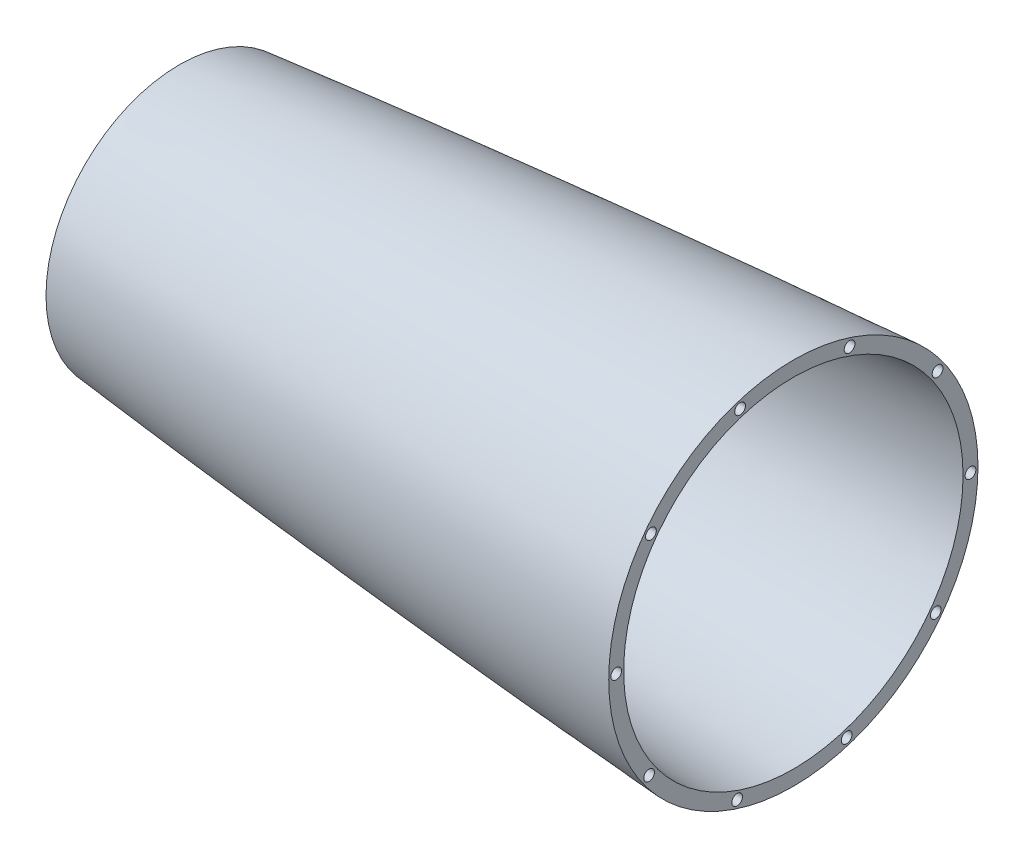
ISO-10303-21;
HEADER;
FILE_DESCRIPTION(('STEP AP214'),'2;1');
FILE_NAME('part.step','',(''),(''),'','','');
FILE_SCHEMA(('AUTOMOTIVE_DESIGN { 1 0 10303 214 1 1 1 1 }'));
ENDSEC;
DATA;
#1=APPLICATION_CONTEXT('core data for automotive mechanical design processes');
#2=APPLICATION_PROTOCOL_DEFINITION('international standard','automotive_design',2000,#1);
#3=PRODUCT_CONTEXT('',#1,'mechanical');
#4=PRODUCT('Part','Part','',(#3));
#5=PRODUCT_RELATED_PRODUCT_CATEGORY('part','',(#4));
#6=PRODUCT_DEFINITION_FORMATION('','',#4);
#7=PRODUCT_DEFINITION_CONTEXT('part definition',#1,'design');
#8=PRODUCT_DEFINITION('design','',#6,#7);
#9=PRODUCT_DEFINITION_SHAPE('','',#8);
#10=(LENGTH_UNIT() NAMED_UNIT(*) SI_UNIT(.MILLI.,.METRE.));
#11=(NAMED_UNIT(*) PLANE_ANGLE_UNIT() SI_UNIT($,.RADIAN.));
#12=(NAMED_UNIT(*) SI_UNIT($,.STERADIAN.) SOLID_ANGLE_UNIT());
#13=UNCERTAINTY_MEASURE_WITH_UNIT(LENGTH_MEASURE(1.E-05),#10,'distance_accuracy_value','');
#14=(GEOMETRIC_REPRESENTATION_CONTEXT(3) GLOBAL_UNCERTAINTY_ASSIGNED_CONTEXT((#13)) GLOBAL_UNIT_ASSIGNED_CONTEXT((#10,
#11,#12)) REPRESENTATION_CONTEXT('',''));
#15=CARTESIAN_POINT('',(0.,0.,0.));
#16=DIRECTION('',(0.,0.,1.));
#17=DIRECTION('',(1.,0.,0.));
#18=AXIS2_PLACEMENT_3D('',#15,#16,#17);
#19=CARTESIAN_POINT('',(-259.812483714893,11.460570284297,0.));
#20=CARTESIAN_POINT('',(-287.312106379697,10.5623408515305,0.));
#21=CARTESIAN_POINT('',(-342.298022137353,8.17156900853598,0.));
#22=CARTESIAN_POINT('',(-452.140135715747,1.83352473554385,0.));
#23=CARTESIAN_POINT('',(-589.280273051557,-8.5121188078909,0.));
#24=CARTESIAN_POINT('',(-726.176632388446,-21.7709007537404,0.));
#25=CARTESIAN_POINT('',(-835.465785428388,-34.5887261399924,0.));
#26=CARTESIAN_POINT('',(-890.027026606975,-41.9652027624198,0.));
#27=CARTESIAN_POINT('',(-917.245364412614,-46.0396236215406,0.));
#28=B_SPLINE_CURVE_WITH_KNOTS('',3,(#19,#20,#21,#22,#23,#24,#25,#26,#27),.UNSPECIFIED.,.F.,.F.,
(4,1,1,1,1,1,4),(0.121539177885851,0.200323508121493,0.279107838357135,0.436676498828419,
0.594245159299703,0.673029489535345,0.751813819770986),.UNSPECIFIED.);
#29=CARTESIAN_POINT('',(0.,-76.2,0.));
#30=DIRECTION('',(1.,0.,0.));
#31=AXIS1_PLACEMENT('',#29,#30);
#32=SURFACE_OF_REVOLUTION('',#28,#31);
#33=CARTESIAN_POINT('',(-699.4652,-76.2,0.));
#34=DIRECTION('',(1.,0.,0.));
#35=DIRECTION('',(0.,0.,-1.));
#36=AXIS2_PLACEMENT_3D('',#33,#34,#35);
#37=CIRCLE('',#36,56.7704938591752);
#38=CARTESIAN_POINT('',(-699.4652,-76.2,-56.7704938591752));
#39=VERTEX_POINT('',#38);
#40=EDGE_CURVE('E163',#39,#39,#37,.F.);
#41=ORIENTED_EDGE('',*,*,#40,.F.);
#42=EDGE_LOOP('',(#41));
#43=FACE_BOUND('',#42,.T.);
#44=CARTESIAN_POINT('',(-438.15,-76.2,0.));
#45=DIRECTION('',(1.,0.,0.));
#46=DIRECTION('',(0.,0.,-1.));
#47=AXIS2_PLACEMENT_3D('',#44,#45,#46);
#48=CIRCLE('',#47,78.5859575802931);
#49=CARTESIAN_POINT('',(-438.15,-76.2,-78.5859575802931));
#50=VERTEX_POINT('',#49);
#51=EDGE_CURVE('E10',#50,#50,#48,.F.);
#52=ORIENTED_EDGE('',*,*,#51,.T.);
#53=EDGE_LOOP('',(#52));
#54=FACE_BOUND('',#53,.T.);
#55=ADVANCED_FACE('F32',(#43,#54),#32,.F.);
#56=CARTESIAN_POINT('',(-259.605182082093,5.11395496327444,0.));
#57=CARTESIAN_POINT('',(-267.12768254606,4.86824499819252,0.));
#58=CARTESIAN_POINT('',(-283.426031509972,4.28566928092725,0.));
#59=CARTESIAN_POINT('',(-317.270262328934,2.88050564552106,0.));
#60=CARTESIAN_POINT('',(-361.130016616179,0.711244662128463,0.));
#61=CARTESIAN_POINT('',(-431.275457268552,-3.37195649395594,0.));
#62=CARTESIAN_POINT('',(-501.372917975129,-8.26687627302136,0.));
#63=CARTESIAN_POINT('',(-571.414486842692,-13.8916826479783,0.));
#64=CARTESIAN_POINT('',(-623.914744737059,-18.4776988889442,0.));
#65=CARTESIAN_POINT('',(-676.380314026956,-23.4393497952148,0.));
#66=CARTESIAN_POINT('',(-728.805663240347,-28.7990620723279,0.));
#67=CARTESIAN_POINT('',(-772.453634614019,-33.627485173269,0.));
#68=CARTESIAN_POINT('',(-807.341816529924,-37.7391545432386,0.));
#69=CARTESIAN_POINT('',(-833.490683910714,-40.9589001471484,0.));
#70=CARTESIAN_POINT('',(-859.619375691871,-44.3289411148186,0.));
#71=CARTESIAN_POINT('',(-885.723877264818,-47.8693351323976,0.));
#72=CARTESIAN_POINT('',(-904.61249297492,-50.577906922154,0.));
#73=CARTESIAN_POINT('',(-914.800968172167,-52.0944643953555,0.));
#74=CARTESIAN_POINT('',(-916.305282206307,-52.3196511250938,0.));
#75=B_SPLINE_CURVE_WITH_KNOTS('',3,(#56,#57,#58,#59,#60,#61,#62,#63,#64,#65,#66,#67,#68,#69,#70,
#71,#72,#73,#74),.UNSPECIFIED.,.F.,.F.,(4,1,1,1,1,1,1,1,1,1,1,1,1,1,1,1,4),(0.121539177885851,
0.143122913317239,0.168303261053087,0.218663956524784,0.26902465199648,0.369746042939873,
0.420106738411569,0.470467433883266,0.520828129354962,0.571188824826659,0.621549520298355,
0.646729868034203,0.671910215770052,0.6970905635059,0.722270911241748,0.747451258977596,
0.751813819770986),.UNSPECIFIED.);
#76=CARTESIAN_POINT('',(0.,-76.2,0.));
#77=DIRECTION('',(1.,0.,0.));
#78=AXIS1_PLACEMENT('',#76,#77);
#79=SURFACE_OF_REVOLUTION('',#75,#78);
#80=CARTESIAN_POINT('',(-699.4652,-76.2,0.));
#81=DIRECTION('',(1.,0.,0.));
#82=DIRECTION('',(0.,0.,-1.));
#83=AXIS2_PLACEMENT_3D('',#80,#81,#82);
#84=CIRCLE('',#83,50.3825636245439);
#85=CARTESIAN_POINT('',(-699.4652,-76.2,-50.3825636245439));
#86=VERTEX_POINT('',#85);
#87=EDGE_CURVE('E36',#86,#86,#84,.F.);
#88=ORIENTED_EDGE('',*,*,#87,.T.);
#89=EDGE_LOOP('',(#88));
#90=FACE_BOUND('',#89,.T.);
#91=CARTESIAN_POINT('',(-438.15,-76.2,0.));
#92=DIRECTION('',(1.,0.,0.));
#93=DIRECTION('',(0.,0.,-1.));
#94=AXIS2_PLACEMENT_3D('',#91,#92,#93);
#95=CIRCLE('',#94,72.2219194807445);
#96=CARTESIAN_POINT('',(-438.15,-76.2,-72.2219194807445));
#97=VERTEX_POINT('',#96);
#98=EDGE_CURVE('E40',#97,#97,#95,.F.);
#99=ORIENTED_EDGE('',*,*,#98,.F.);
#100=EDGE_LOOP('',(#99));
#101=FACE_BOUND('',#100,.T.);
#102=ADVANCED_FACE('F62',(#90,#101),#79,.T.);
#103=CARTESIAN_POINT('',(-438.15,-76.2,0.));
#104=DIRECTION('',(1.,0.,0.));
#105=DIRECTION('',(0.,0.,-1.));
#106=AXIS2_PLACEMENT_3D('',#103,#104,#105);
#107=PLANE('',#106);
#108=CARTESIAN_POINT('',(-438.15,-4.28598565713197,22.6744016257323));
#109=DIRECTION('',(1.,0.,0.));
#110=DIRECTION('',(0.,0.,-1.));
#111=AXIS2_PLACEMENT_3D('',#108,#109,#110);
#112=CIRCLE('',#111,2.286);
#113=CARTESIAN_POINT('',(-438.15,-4.28598565713197,20.3884016257323));
#114=VERTEX_POINT('',#113);
#115=EDGE_CURVE('E164',#114,#114,#112,.T.);
#116=ORIENTED_EDGE('',*,*,#115,.F.);
#117=EDGE_LOOP('',(#116));
#118=FACE_BOUND('',#117,.T.);
#119=CARTESIAN_POINT('',(-438.15,-31.3480191430601,60.6139733163877));
#120=DIRECTION('',(1.,0.,0.));
#121=DIRECTION('',(0.,0.,-1.));
#122=AXIS2_PLACEMENT_3D('',#119,#120,#121);
#123=CIRCLE('',#122,2.286);
#124=CARTESIAN_POINT('',(-438.15,-31.3480191430601,58.3279733163877));
#125=VERTEX_POINT('',#124);
#126=EDGE_CURVE('E216',#125,#125,#123,.T.);
#127=ORIENTED_EDGE('',*,*,#126,.F.);
#128=EDGE_LOOP('',(#127));
#129=FACE_BOUND('',#128,.T.);
#130=CARTESIAN_POINT('',(-438.15,-75.5419848535801,75.4010673933609));
#131=DIRECTION('',(1.,0.,0.));
#132=DIRECTION('',(0.,0.,-1.));
#133=AXIS2_PLACEMENT_3D('',#130,#131,#132);
#134=CIRCLE('',#133,2.286);
#135=CARTESIAN_POINT('',(-438.15,-75.5419848535801,73.1150673933609));
#136=VERTEX_POINT('',#135);
#137=EDGE_CURVE('E210',#136,#136,#134,.T.);
#138=ORIENTED_EDGE('',*,*,#137,.F.);
#139=EDGE_LOOP('',(#138));
#140=FACE_BOUND('',#139,.T.);
#141=CARTESIAN_POINT('',(-438.15,-119.987289984921,61.3875165140904));
#142=DIRECTION('',(1.,0.,0.));
#143=DIRECTION('',(0.,0.,-1.));
#144=AXIS2_PLACEMENT_3D('',#141,#142,#143);
#145=CIRCLE('',#144,2.28599999999998);
#146=CARTESIAN_POINT('',(-438.15,-119.987289984921,59.1015165140904));
#147=VERTEX_POINT('',#146);
#148=EDGE_CURVE('E204',#147,#147,#145,.T.);
#149=ORIENTED_EDGE('',*,*,#148,.F.);
#150=EDGE_LOOP('',(#149));
#151=FACE_BOUND('',#150,.T.);
#152=CARTESIAN_POINT('',(-438.15,-147.70733861727,23.9260208113815));
#153=DIRECTION('',(1.,0.,0.));
#154=DIRECTION('',(0.,0.,-1.));
#155=AXIS2_PLACEMENT_3D('',#152,#153,#154);
#156=CIRCLE('',#155,2.286);
#157=CARTESIAN_POINT('',(-438.15,-147.70733861727,21.6400208113815));
#158=VERTEX_POINT('',#157);
#159=EDGE_CURVE('E198',#158,#158,#156,.T.);
#160=ORIENTED_EDGE('',*,*,#159,.F.);
#161=EDGE_LOOP('',(#160));
#162=FACE_BOUND('',#161,.T.);
#163=CARTESIAN_POINT('',(-438.15,-148.11401434287,-22.6744016257389));
#164=DIRECTION('',(1.,0.,0.));
#165=DIRECTION('',(0.,0.,-1.));
#166=AXIS2_PLACEMENT_3D('',#163,#164,#165);
#167=CIRCLE('',#166,2.28600000000001);
#168=CARTESIAN_POINT('',(-438.15,-148.11401434287,-24.9604016257389));
#169=VERTEX_POINT('',#168);
#170=EDGE_CURVE('E192',#169,#169,#167,.T.);
#171=ORIENTED_EDGE('',*,*,#170,.F.);
#172=EDGE_LOOP('',(#171));
#173=FACE_BOUND('',#172,.T.);
#174=CARTESIAN_POINT('',(-438.15,-121.051980856942,-60.6139733163942));
#175=DIRECTION('',(1.,0.,0.));
#176=DIRECTION('',(0.,0.,-1.));
#177=AXIS2_PLACEMENT_3D('',#174,#175,#176);
#178=CIRCLE('',#177,2.286);
#179=CARTESIAN_POINT('',(-438.15,-121.051980856942,-62.8999733163942));
#180=VERTEX_POINT('',#179);
#181=EDGE_CURVE('E186',#180,#180,#178,.T.);
#182=ORIENTED_EDGE('',*,*,#181,.F.);
#183=EDGE_LOOP('',(#182));
#184=FACE_BOUND('',#183,.T.);
#185=CARTESIAN_POINT('',(-438.15,-76.8580151464216,-75.401067393367));
#186=DIRECTION('',(1.,0.,0.));
#187=DIRECTION('',(0.,0.,-1.));
#188=AXIS2_PLACEMENT_3D('',#185,#186,#187);
#189=CIRCLE('',#188,2.28599999999999);
#190=CARTESIAN_POINT('',(-438.15,-76.8580151464216,-77.687067393367));
#191=VERTEX_POINT('',#190);
#192=EDGE_CURVE('E180',#191,#191,#189,.T.);
#193=ORIENTED_EDGE('',*,*,#192,.F.);
#194=EDGE_LOOP('',(#193));
#195=FACE_BOUND('',#194,.T.);
#196=CARTESIAN_POINT('',(-438.15,-32.4127100150811,-61.3875165140962));
#197=DIRECTION('',(1.,0.,0.));
#198=DIRECTION('',(0.,0.,-1.));
#199=AXIS2_PLACEMENT_3D('',#196,#197,#198);
#200=CIRCLE('',#199,2.286);
#201=CARTESIAN_POINT('',(-438.15,-32.4127100150811,-63.6735165140962));
#202=VERTEX_POINT('',#201);
#203=EDGE_CURVE('E174',#202,#202,#200,.T.);
#204=ORIENTED_EDGE('',*,*,#203,.F.);
#205=EDGE_LOOP('',(#204));
#206=FACE_BOUND('',#205,.T.);
#207=CARTESIAN_POINT('',(-438.15,-4.69266138273224,-23.9260208113871));
#208=DIRECTION('',(1.,0.,0.));
#209=DIRECTION('',(0.,0.,-1.));
#210=AXIS2_PLACEMENT_3D('',#207,#208,#209);
#211=CIRCLE('',#210,2.286);
#212=CARTESIAN_POINT('',(-438.15,-4.69266138273224,-26.2120208113871));
#213=VERTEX_POINT('',#212);
#214=EDGE_CURVE('E47',#213,#213,#211,.T.);
#215=ORIENTED_EDGE('',*,*,#214,.F.);
#216=EDGE_LOOP('',(#215));
#217=FACE_BOUND('',#216,.T.);
#218=ORIENTED_EDGE('',*,*,#51,.F.);
#219=EDGE_LOOP('',(#218));
#220=FACE_BOUND('',#219,.T.);
#221=ORIENTED_EDGE('',*,*,#98,.T.);
#222=EDGE_LOOP('',(#221));
#223=FACE_BOUND('',#222,.T.);
#224=ADVANCED_FACE('F65',(#118,#129,#140,#151,#162,#173,#184,#195,#206,#217,#220,#223),#107,.T.);
#225=CARTESIAN_POINT('',(-448.31,-4.69266138273224,-23.9260208113871));
#226=DIRECTION('',(1.,0.,0.));
#227=DIRECTION('',(0.,0.,-1.));
#228=AXIS2_PLACEMENT_3D('',#225,#226,#227);
#229=CYLINDRICAL_SURFACE('',#228,2.286);
#230=CARTESIAN_POINT('',(-448.31,-4.69266138273224,-23.9260208113871));
#231=DIRECTION('',(1.,0.,0.));
#232=DIRECTION('',(0.,0.,-1.));
#233=AXIS2_PLACEMENT_3D('',#230,#231,#232);
#234=CIRCLE('',#233,2.286);
#235=CARTESIAN_POINT('',(-448.31,-4.69266138273224,-26.2120208113871));
#236=VERTEX_POINT('',#235);
#237=EDGE_CURVE('E45',#236,#236,#234,.T.);
#238=ORIENTED_EDGE('',*,*,#237,.F.);
#239=EDGE_LOOP('',(#238));
#240=FACE_BOUND('',#239,.T.);
#241=ORIENTED_EDGE('',*,*,#214,.T.);
#242=EDGE_LOOP('',(#241));
#243=FACE_BOUND('',#242,.T.);
#244=ADVANCED_FACE('F69',(#240,#243),#229,.F.);
#245=CARTESIAN_POINT('',(-448.31,-4.69266138273224,-23.9260208113871));
#246=DIRECTION('',(1.,0.,0.));
#247=DIRECTION('',(0.,0.,-1.));
#248=AXIS2_PLACEMENT_3D('',#245,#246,#247);
#249=PLANE('',#248);
#250=ORIENTED_EDGE('',*,*,#237,.T.);
#251=EDGE_LOOP('',(#250));
#252=FACE_BOUND('',#251,.T.);
#253=ADVANCED_FACE('F73',(#252),#249,.T.);
#254=CARTESIAN_POINT('',(-448.31,-32.4127100150811,-61.3875165140962));
#255=DIRECTION('',(1.,0.,0.));
#256=DIRECTION('',(0.,0.,-1.));
#257=AXIS2_PLACEMENT_3D('',#254,#255,#256);
#258=CYLINDRICAL_SURFACE('',#257,2.286);
#259=CARTESIAN_POINT('',(-448.31,-32.4127100150811,-61.3875165140962));
#260=DIRECTION('',(1.,0.,0.));
#261=DIRECTION('',(0.,0.,-1.));
#262=AXIS2_PLACEMENT_3D('',#259,#260,#261);
#263=CIRCLE('',#262,2.286);
#264=CARTESIAN_POINT('',(-448.31,-32.4127100150811,-63.6735165140962));
#265=VERTEX_POINT('',#264);
#266=EDGE_CURVE('E171',#265,#265,#263,.T.);
#267=ORIENTED_EDGE('',*,*,#266,.F.);
#268=EDGE_LOOP('',(#267));
#269=FACE_BOUND('',#268,.T.);
#270=ORIENTED_EDGE('',*,*,#203,.T.);
#271=EDGE_LOOP('',(#270));
#272=FACE_BOUND('',#271,.T.);
#273=ADVANCED_FACE('F77',(#269,#272),#258,.F.);
#274=CARTESIAN_POINT('',(-448.31,-32.4127100150811,-61.3875165140962));
#275=DIRECTION('',(1.,0.,0.));
#276=DIRECTION('',(0.,0.,-1.));
#277=AXIS2_PLACEMENT_3D('',#274,#275,#276);
#278=PLANE('',#277);
#279=ORIENTED_EDGE('',*,*,#266,.T.);
#280=EDGE_LOOP('',(#279));
#281=FACE_BOUND('',#280,.T.);
#282=ADVANCED_FACE('F140',(#281),#278,.T.);
#283=CARTESIAN_POINT('',(-448.31,-76.8580151464216,-75.401067393367));
#284=DIRECTION('',(1.,0.,0.));
#285=DIRECTION('',(0.,0.,-1.));
#286=AXIS2_PLACEMENT_3D('',#283,#284,#285);
#287=CYLINDRICAL_SURFACE('',#286,2.28599999999999);
#288=CARTESIAN_POINT('',(-448.31,-76.8580151464216,-75.401067393367));
#289=DIRECTION('',(1.,0.,0.));
#290=DIRECTION('',(0.,0.,-1.));
#291=AXIS2_PLACEMENT_3D('',#288,#289,#290);
#292=CIRCLE('',#291,2.28599999999999);
#293=CARTESIAN_POINT('',(-448.31,-76.8580151464216,-77.687067393367));
#294=VERTEX_POINT('',#293);
#295=EDGE_CURVE('E177',#294,#294,#292,.T.);
#296=ORIENTED_EDGE('',*,*,#295,.F.);
#297=EDGE_LOOP('',(#296));
#298=FACE_BOUND('',#297,.T.);
#299=ORIENTED_EDGE('',*,*,#192,.T.);
#300=EDGE_LOOP('',(#299));
#301=FACE_BOUND('',#300,.T.);
#302=ADVANCED_FACE('F137',(#298,#301),#287,.F.);
#303=CARTESIAN_POINT('',(-448.31,-76.8580151464216,-75.401067393367));
#304=DIRECTION('',(1.,0.,0.));
#305=DIRECTION('',(0.,0.,-1.));
#306=AXIS2_PLACEMENT_3D('',#303,#304,#305);
#307=PLANE('',#306);
#308=ORIENTED_EDGE('',*,*,#295,.T.);
#309=EDGE_LOOP('',(#308));
#310=FACE_BOUND('',#309,.T.);
#311=ADVANCED_FACE('F132',(#310),#307,.T.);
#312=CARTESIAN_POINT('',(-448.31,-121.051980856942,-60.6139733163942));
#313=DIRECTION('',(1.,0.,0.));
#314=DIRECTION('',(0.,0.,-1.));
#315=AXIS2_PLACEMENT_3D('',#312,#313,#314);
#316=CYLINDRICAL_SURFACE('',#315,2.286);
#317=CARTESIAN_POINT('',(-448.31,-121.051980856942,-60.6139733163942));
#318=DIRECTION('',(1.,0.,0.));
#319=DIRECTION('',(0.,0.,-1.));
#320=AXIS2_PLACEMENT_3D('',#317,#318,#319);
#321=CIRCLE('',#320,2.286);
#322=CARTESIAN_POINT('',(-448.31,-121.051980856942,-62.8999733163942));
#323=VERTEX_POINT('',#322);
#324=EDGE_CURVE('E183',#323,#323,#321,.T.);
#325=ORIENTED_EDGE('',*,*,#324,.F.);
#326=EDGE_LOOP('',(#325));
#327=FACE_BOUND('',#326,.T.);
#328=ORIENTED_EDGE('',*,*,#181,.T.);
#329=EDGE_LOOP('',(#328));
#330=FACE_BOUND('',#329,.T.);
#331=ADVANCED_FACE('F129',(#327,#330),#316,.F.);
#332=CARTESIAN_POINT('',(-448.31,-121.051980856942,-60.6139733163942));
#333=DIRECTION('',(1.,0.,0.));
#334=DIRECTION('',(0.,0.,-1.));
#335=AXIS2_PLACEMENT_3D('',#332,#333,#334);
#336=PLANE('',#335);
#337=ORIENTED_EDGE('',*,*,#324,.T.);
#338=EDGE_LOOP('',(#337));
#339=FACE_BOUND('',#338,.T.);
#340=ADVANCED_FACE('F124',(#339),#336,.T.);
#341=CARTESIAN_POINT('',(-448.31,-148.11401434287,-22.6744016257389));
#342=DIRECTION('',(1.,0.,0.));
#343=DIRECTION('',(0.,0.,-1.));
#344=AXIS2_PLACEMENT_3D('',#341,#342,#343);
#345=CYLINDRICAL_SURFACE('',#344,2.28600000000001);
#346=CARTESIAN_POINT('',(-448.31,-148.11401434287,-22.6744016257389));
#347=DIRECTION('',(1.,0.,0.));
#348=DIRECTION('',(0.,0.,-1.));
#349=AXIS2_PLACEMENT_3D('',#346,#347,#348);
#350=CIRCLE('',#349,2.28600000000001);
#351=CARTESIAN_POINT('',(-448.31,-148.11401434287,-24.9604016257389));
#352=VERTEX_POINT('',#351);
#353=EDGE_CURVE('E189',#352,#352,#350,.T.);
#354=ORIENTED_EDGE('',*,*,#353,.F.);
#355=EDGE_LOOP('',(#354));
#356=FACE_BOUND('',#355,.T.);
#357=ORIENTED_EDGE('',*,*,#170,.T.);
#358=EDGE_LOOP('',(#357));
#359=FACE_BOUND('',#358,.T.);
#360=ADVANCED_FACE('F121',(#356,#359),#345,.F.);
#361=CARTESIAN_POINT('',(-448.31,-148.11401434287,-22.6744016257389));
#362=DIRECTION('',(1.,0.,0.));
#363=DIRECTION('',(0.,0.,-1.));
#364=AXIS2_PLACEMENT_3D('',#361,#362,#363);
#365=PLANE('',#364);
#366=ORIENTED_EDGE('',*,*,#353,.T.);
#367=EDGE_LOOP('',(#366));
#368=FACE_BOUND('',#367,.T.);
#369=ADVANCED_FACE('F116',(#368),#365,.T.);
#370=CARTESIAN_POINT('',(-448.31,-147.70733861727,23.9260208113815));
#371=DIRECTION('',(1.,0.,0.));
#372=DIRECTION('',(0.,0.,-1.));
#373=AXIS2_PLACEMENT_3D('',#370,#371,#372);
#374=CYLINDRICAL_SURFACE('',#373,2.286);
#375=CARTESIAN_POINT('',(-448.31,-147.70733861727,23.9260208113815));
#376=DIRECTION('',(1.,0.,0.));
#377=DIRECTION('',(0.,0.,-1.));
#378=AXIS2_PLACEMENT_3D('',#375,#376,#377);
#379=CIRCLE('',#378,2.286);
#380=CARTESIAN_POINT('',(-448.31,-147.70733861727,21.6400208113815));
#381=VERTEX_POINT('',#380);
#382=EDGE_CURVE('E195',#381,#381,#379,.T.);
#383=ORIENTED_EDGE('',*,*,#382,.F.);
#384=EDGE_LOOP('',(#383));
#385=FACE_BOUND('',#384,.T.);
#386=ORIENTED_EDGE('',*,*,#159,.T.);
#387=EDGE_LOOP('',(#386));
#388=FACE_BOUND('',#387,.T.);
#389=ADVANCED_FACE('F113',(#385,#388),#374,.F.);
#390=CARTESIAN_POINT('',(-448.31,-147.70733861727,23.9260208113815));
#391=DIRECTION('',(1.,0.,0.));
#392=DIRECTION('',(0.,0.,-1.));
#393=AXIS2_PLACEMENT_3D('',#390,#391,#392);
#394=PLANE('',#393);
#395=ORIENTED_EDGE('',*,*,#382,.T.);
#396=EDGE_LOOP('',(#395));
#397=FACE_BOUND('',#396,.T.);
#398=ADVANCED_FACE('F108',(#397),#394,.T.);
#399=CARTESIAN_POINT('',(-448.31,-119.987289984921,61.3875165140904));
#400=DIRECTION('',(1.,0.,0.));
#401=DIRECTION('',(0.,0.,-1.));
#402=AXIS2_PLACEMENT_3D('',#399,#400,#401);
#403=CYLINDRICAL_SURFACE('',#402,2.28599999999998);
#404=CARTESIAN_POINT('',(-448.31,-119.987289984921,61.3875165140904));
#405=DIRECTION('',(1.,0.,0.));
#406=DIRECTION('',(0.,0.,-1.));
#407=AXIS2_PLACEMENT_3D('',#404,#405,#406);
#408=CIRCLE('',#407,2.28599999999998);
#409=CARTESIAN_POINT('',(-448.31,-119.987289984921,59.1015165140904));
#410=VERTEX_POINT('',#409);
#411=EDGE_CURVE('E201',#410,#410,#408,.T.);
#412=ORIENTED_EDGE('',*,*,#411,.F.);
#413=EDGE_LOOP('',(#412));
#414=FACE_BOUND('',#413,.T.);
#415=ORIENTED_EDGE('',*,*,#148,.T.);
#416=EDGE_LOOP('',(#415));
#417=FACE_BOUND('',#416,.T.);
#418=ADVANCED_FACE('F105',(#414,#417),#403,.F.);
#419=CARTESIAN_POINT('',(-448.31,-119.987289984921,61.3875165140904));
#420=DIRECTION('',(1.,0.,0.));
#421=DIRECTION('',(0.,0.,-1.));
#422=AXIS2_PLACEMENT_3D('',#419,#420,#421);
#423=PLANE('',#422);
#424=ORIENTED_EDGE('',*,*,#411,.T.);
#425=EDGE_LOOP('',(#424));
#426=FACE_BOUND('',#425,.T.);
#427=ADVANCED_FACE('F100',(#426),#423,.T.);
#428=CARTESIAN_POINT('',(-448.31,-75.5419848535801,75.4010673933609));
#429=DIRECTION('',(1.,0.,0.));
#430=DIRECTION('',(0.,0.,-1.));
#431=AXIS2_PLACEMENT_3D('',#428,#429,#430);
#432=CYLINDRICAL_SURFACE('',#431,2.286);
#433=CARTESIAN_POINT('',(-448.31,-75.5419848535801,75.4010673933609));
#434=DIRECTION('',(1.,0.,0.));
#435=DIRECTION('',(0.,0.,-1.));
#436=AXIS2_PLACEMENT_3D('',#433,#434,#435);
#437=CIRCLE('',#436,2.286);
#438=CARTESIAN_POINT('',(-448.31,-75.5419848535801,73.1150673933609));
#439=VERTEX_POINT('',#438);
#440=EDGE_CURVE('E207',#439,#439,#437,.T.);
#441=ORIENTED_EDGE('',*,*,#440,.F.);
#442=EDGE_LOOP('',(#441));
#443=FACE_BOUND('',#442,.T.);
#444=ORIENTED_EDGE('',*,*,#137,.T.);
#445=EDGE_LOOP('',(#444));
#446=FACE_BOUND('',#445,.T.);
#447=ADVANCED_FACE('F97',(#443,#446),#432,.F.);
#448=CARTESIAN_POINT('',(-448.31,-75.5419848535801,75.4010673933609));
#449=DIRECTION('',(1.,0.,0.));
#450=DIRECTION('',(0.,0.,-1.));
#451=AXIS2_PLACEMENT_3D('',#448,#449,#450);
#452=PLANE('',#451);
#453=ORIENTED_EDGE('',*,*,#440,.T.);
#454=EDGE_LOOP('',(#453));
#455=FACE_BOUND('',#454,.T.);
#456=ADVANCED_FACE('F92',(#455),#452,.T.);
#457=CARTESIAN_POINT('',(-448.31,-31.3480191430601,60.6139733163877));
#458=DIRECTION('',(1.,0.,0.));
#459=DIRECTION('',(0.,0.,-1.));
#460=AXIS2_PLACEMENT_3D('',#457,#458,#459);
#461=CYLINDRICAL_SURFACE('',#460,2.286);
#462=CARTESIAN_POINT('',(-448.31,-31.3480191430601,60.6139733163877));
#463=DIRECTION('',(1.,0.,0.));
#464=DIRECTION('',(0.,0.,-1.));
#465=AXIS2_PLACEMENT_3D('',#462,#463,#464);
#466=CIRCLE('',#465,2.286);
#467=CARTESIAN_POINT('',(-448.31,-31.3480191430601,58.3279733163877));
#468=VERTEX_POINT('',#467);
#469=EDGE_CURVE('E213',#468,#468,#466,.T.);
#470=ORIENTED_EDGE('',*,*,#469,.F.);
#471=EDGE_LOOP('',(#470));
#472=FACE_BOUND('',#471,.T.);
#473=ORIENTED_EDGE('',*,*,#126,.T.);
#474=EDGE_LOOP('',(#473));
#475=FACE_BOUND('',#474,.T.);
#476=ADVANCED_FACE('F89',(#472,#475),#461,.F.);
#477=CARTESIAN_POINT('',(-448.31,-31.3480191430601,60.6139733163877));
#478=DIRECTION('',(1.,0.,0.));
#479=DIRECTION('',(0.,0.,-1.));
#480=AXIS2_PLACEMENT_3D('',#477,#478,#479);
#481=PLANE('',#480);
#482=ORIENTED_EDGE('',*,*,#469,.T.);
#483=EDGE_LOOP('',(#482));
#484=FACE_BOUND('',#483,.T.);
#485=ADVANCED_FACE('F83',(#484),#481,.T.);
#486=CARTESIAN_POINT('',(-448.31,-4.28598565713197,22.6744016257323));
#487=DIRECTION('',(1.,0.,0.));
#488=DIRECTION('',(0.,0.,-1.));
#489=AXIS2_PLACEMENT_3D('',#486,#487,#488);
#490=CYLINDRICAL_SURFACE('',#489,2.286);
#491=CARTESIAN_POINT('',(-448.31,-4.28598565713197,22.6744016257323));
#492=DIRECTION('',(1.,0.,0.));
#493=DIRECTION('',(0.,0.,-1.));
#494=AXIS2_PLACEMENT_3D('',#491,#492,#493);
#495=CIRCLE('',#494,2.286);
#496=CARTESIAN_POINT('',(-448.31,-4.28598565713197,20.3884016257323));
#497=VERTEX_POINT('',#496);
#498=EDGE_CURVE('E167',#497,#497,#495,.T.);
#499=ORIENTED_EDGE('',*,*,#498,.F.);
#500=EDGE_LOOP('',(#499));
#501=FACE_BOUND('',#500,.T.);
#502=ORIENTED_EDGE('',*,*,#115,.T.);
#503=EDGE_LOOP('',(#502));
#504=FACE_BOUND('',#503,.T.);
#505=ADVANCED_FACE('F79',(#501,#504),#490,.F.);
#506=CARTESIAN_POINT('',(-448.31,-4.28598565713197,22.6744016257323));
#507=DIRECTION('',(1.,0.,0.));
#508=DIRECTION('',(0.,0.,-1.));
#509=AXIS2_PLACEMENT_3D('',#506,#507,#508);
#510=PLANE('',#509);
#511=ORIENTED_EDGE('',*,*,#498,.T.);
#512=EDGE_LOOP('',(#511));
#513=FACE_BOUND('',#512,.T.);
#514=ADVANCED_FACE('F82',(#513),#510,.T.);
#515=CARTESIAN_POINT('',(-699.4652,-76.2,0.));
#516=DIRECTION('',(1.,0.,0.));
#517=DIRECTION('',(0.,0.,-1.));
#518=AXIS2_PLACEMENT_3D('',#515,#516,#517);
#519=PLANE('',#518);
#520=ORIENTED_EDGE('',*,*,#40,.T.);
#521=EDGE_LOOP('',(#520));
#522=FACE_BOUND('',#521,.T.);
#523=ORIENTED_EDGE('',*,*,#87,.F.);
#524=EDGE_LOOP('',(#523));
#525=FACE_BOUND('',#524,.T.);
#526=ADVANCED_FACE('F87',(#522,#525),#519,.F.);
#527=CLOSED_SHELL('',(#55,#102,#224,#244,#253,#273,#282,#302,#311,#331,#340,#360,#369,#389,#398,
#418,#427,#447,#456,#476,#485,#505,#514,#526));
#528=MANIFOLD_SOLID_BREP('B2',#527);
#529=ADVANCED_BREP_SHAPE_REPRESENTATION('',(#18,#528),#14);
#530=SHAPE_DEFINITION_REPRESENTATION(#9,#529);
ENDSEC;
END-ISO-10303-21;
